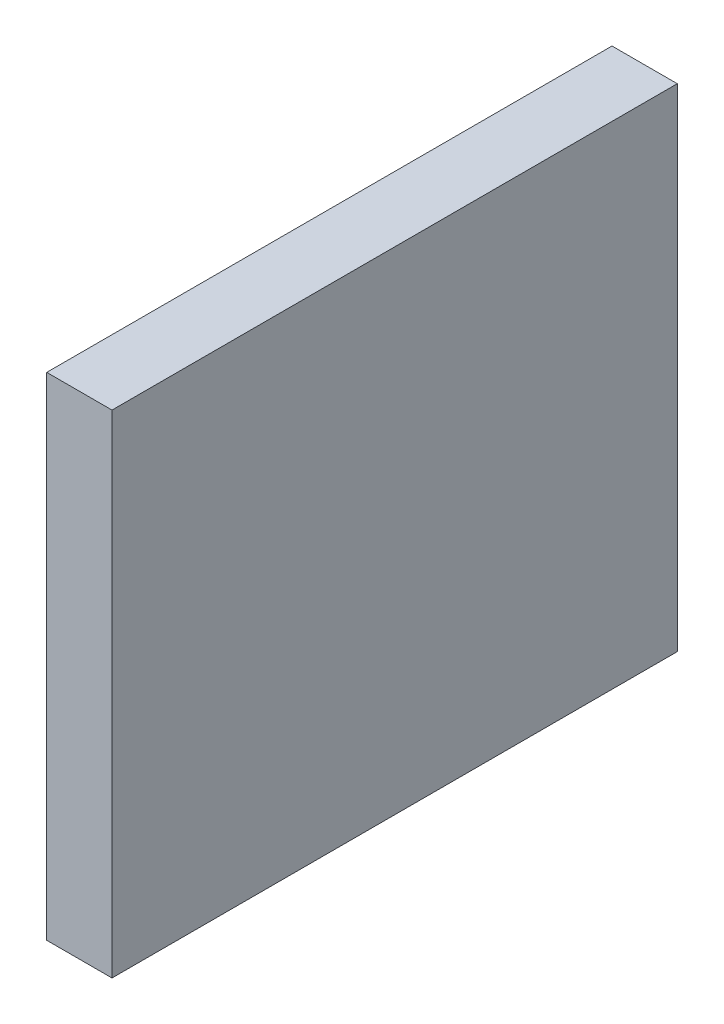
ISO-10303-21;
HEADER;
FILE_DESCRIPTION(('STEP AP214'),'2;1');
FILE_NAME('part.step','',(''),(''),'','','');
FILE_SCHEMA(('AUTOMOTIVE_DESIGN { 1 0 10303 214 1 1 1 1 }'));
ENDSEC;
DATA;
#1=APPLICATION_CONTEXT('core data for automotive mechanical design processes');
#2=APPLICATION_PROTOCOL_DEFINITION('international standard','automotive_design',2000,#1);
#3=PRODUCT_CONTEXT('',#1,'mechanical');
#4=PRODUCT('Part','Part','',(#3));
#5=PRODUCT_RELATED_PRODUCT_CATEGORY('part','',(#4));
#6=PRODUCT_DEFINITION_FORMATION('','',#4);
#7=PRODUCT_DEFINITION_CONTEXT('part definition',#1,'design');
#8=PRODUCT_DEFINITION('design','',#6,#7);
#9=PRODUCT_DEFINITION_SHAPE('','',#8);
#10=(LENGTH_UNIT() NAMED_UNIT(*) SI_UNIT(.MILLI.,.METRE.));
#11=(NAMED_UNIT(*) PLANE_ANGLE_UNIT() SI_UNIT($,.RADIAN.));
#12=(NAMED_UNIT(*) SI_UNIT($,.STERADIAN.) SOLID_ANGLE_UNIT());
#13=UNCERTAINTY_MEASURE_WITH_UNIT(LENGTH_MEASURE(1.E-05),#10,'distance_accuracy_value','');
#14=(GEOMETRIC_REPRESENTATION_CONTEXT(3) GLOBAL_UNCERTAINTY_ASSIGNED_CONTEXT((#13)) GLOBAL_UNIT_ASSIGNED_CONTEXT((#10,
#11,#12)) REPRESENTATION_CONTEXT('',''));
#15=CARTESIAN_POINT('',(0.,0.,0.));
#16=DIRECTION('',(0.,0.,1.));
#17=DIRECTION('',(1.,0.,0.));
#18=AXIS2_PLACEMENT_3D('',#15,#16,#17);
#19=CARTESIAN_POINT('',(21.1649890422365,13.3138602307418,28.7224037022303));
#20=DIRECTION('',(0.,0.,1.));
#21=DIRECTION('',(0.,-1.,0.));
#22=AXIS2_PLACEMENT_3D('',#19,#20,#21);
#23=PLANE('',#22);
#24=DIRECTION('',(0.,-1.,0.));
#25=VECTOR('',#24,1.);
#26=CARTESIAN_POINT('',(21.3428080531015,13.3138602307418,28.7224037022303));
#27=LINE('',#26,#25);
#28=CARTESIAN_POINT('',(21.3428080531015,13.3138602307418,28.7224037022303));
#29=VERTEX_POINT('',#28);
#30=CARTESIAN_POINT('',(21.3428080531015,11.9741613642592,28.7224037022303));
#31=VERTEX_POINT('',#30);
#32=EDGE_CURVE('E80',#29,#31,#27,.T.);
#33=ORIENTED_EDGE('',*,*,#32,.F.);
#34=DIRECTION('',(1.,0.,0.));
#35=VECTOR('',#34,1.);
#36=CARTESIAN_POINT('',(21.1649890422365,13.3138602307418,28.7224037022303));
#37=LINE('',#36,#35);
#38=CARTESIAN_POINT('',(21.1649890422365,13.3138602307418,28.7224037022303));
#39=VERTEX_POINT('',#38);
#40=EDGE_CURVE('E33',#39,#29,#37,.T.);
#41=ORIENTED_EDGE('',*,*,#40,.F.);
#42=DIRECTION('',(0.,-1.,0.));
#43=VECTOR('',#42,1.);
#44=CARTESIAN_POINT('',(21.1649890422365,13.3138602307418,28.7224037022303));
#45=LINE('',#44,#43);
#46=CARTESIAN_POINT('',(21.1649890422365,11.9741613642592,28.7224037022303));
#47=VERTEX_POINT('',#46);
#48=EDGE_CURVE('E72',#39,#47,#45,.T.);
#49=ORIENTED_EDGE('',*,*,#48,.T.);
#50=DIRECTION('',(1.,0.,0.));
#51=VECTOR('',#50,1.);
#52=CARTESIAN_POINT('',(21.1649890422365,11.9741613642592,28.7224037022303));
#53=LINE('',#52,#51);
#54=EDGE_CURVE('E11',#47,#31,#53,.T.);
#55=ORIENTED_EDGE('',*,*,#54,.T.);
#56=EDGE_LOOP('',(#33,#41,#49,#55));
#57=FACE_BOUND('',#56,.T.);
#58=ADVANCED_FACE('F17',(#57),#23,.T.);
#59=CARTESIAN_POINT('',(21.1649890422365,11.9741613642592,28.7224037022303));
#60=DIRECTION('',(0.,-1.,0.));
#61=DIRECTION('',(0.,0.,-1.));
#62=AXIS2_PLACEMENT_3D('',#59,#60,#61);
#63=PLANE('',#62);
#64=DIRECTION('',(0.,0.,-1.));
#65=VECTOR('',#64,1.);
#66=CARTESIAN_POINT('',(21.3428080531015,11.9741613642592,28.7224037022303));
#67=LINE('',#66,#65);
#68=CARTESIAN_POINT('',(21.3428080531015,11.9741613642592,27.1827048357478));
#69=VERTEX_POINT('',#68);
#70=EDGE_CURVE('E83',#31,#69,#67,.T.);
#71=ORIENTED_EDGE('',*,*,#70,.F.);
#72=ORIENTED_EDGE('',*,*,#54,.F.);
#73=DIRECTION('',(0.,0.,-1.));
#74=VECTOR('',#73,1.);
#75=CARTESIAN_POINT('',(21.1649890422365,11.9741613642592,28.7224037022303));
#76=LINE('',#75,#74);
#77=CARTESIAN_POINT('',(21.1649890422365,11.9741613642592,27.1827048357478));
#78=VERTEX_POINT('',#77);
#79=EDGE_CURVE('E68',#47,#78,#76,.T.);
#80=ORIENTED_EDGE('',*,*,#79,.T.);
#81=DIRECTION('',(1.,0.,0.));
#82=VECTOR('',#81,1.);
#83=CARTESIAN_POINT('',(21.1649890422365,11.9741613642592,27.1827048357478));
#84=LINE('',#83,#82);
#85=EDGE_CURVE('E25',#78,#69,#84,.T.);
#86=ORIENTED_EDGE('',*,*,#85,.T.);
#87=EDGE_LOOP('',(#71,#72,#80,#86));
#88=FACE_BOUND('',#87,.T.);
#89=ADVANCED_FACE('F69',(#88),#63,.T.);
#90=CARTESIAN_POINT('',(21.1649890422365,11.9741613642592,27.1827048357478));
#91=DIRECTION('',(0.,0.,-1.));
#92=DIRECTION('',(0.,1.,0.));
#93=AXIS2_PLACEMENT_3D('',#90,#91,#92);
#94=PLANE('',#93);
#95=DIRECTION('',(0.,1.,0.));
#96=VECTOR('',#95,1.);
#97=CARTESIAN_POINT('',(21.3428080531015,11.9741613642592,27.1827048357478));
#98=LINE('',#97,#96);
#99=CARTESIAN_POINT('',(21.3428080531015,13.3138602307418,27.1827048357478));
#100=VERTEX_POINT('',#99);
#101=EDGE_CURVE('E66',#69,#100,#98,.T.);
#102=ORIENTED_EDGE('',*,*,#101,.F.);
#103=ORIENTED_EDGE('',*,*,#85,.F.);
#104=DIRECTION('',(0.,1.,0.));
#105=VECTOR('',#104,1.);
#106=CARTESIAN_POINT('',(21.1649890422365,11.9741613642592,27.1827048357478));
#107=LINE('',#106,#105);
#108=CARTESIAN_POINT('',(21.1649890422365,13.3138602307418,27.1827048357478));
#109=VERTEX_POINT('',#108);
#110=EDGE_CURVE('E63',#78,#109,#107,.T.);
#111=ORIENTED_EDGE('',*,*,#110,.T.);
#112=DIRECTION('',(1.,0.,0.));
#113=VECTOR('',#112,1.);
#114=CARTESIAN_POINT('',(21.1649890422365,13.3138602307418,27.1827048357478));
#115=LINE('',#114,#113);
#116=EDGE_CURVE('E49',#109,#100,#115,.T.);
#117=ORIENTED_EDGE('',*,*,#116,.T.);
#118=EDGE_LOOP('',(#102,#103,#111,#117));
#119=FACE_BOUND('',#118,.T.);
#120=ADVANCED_FACE('F61',(#119),#94,.T.);
#121=CARTESIAN_POINT('',(21.1649890422365,13.3138602307418,27.1827048357478));
#122=DIRECTION('',(0.,1.,0.));
#123=DIRECTION('',(0.,0.,1.));
#124=AXIS2_PLACEMENT_3D('',#121,#122,#123);
#125=PLANE('',#124);
#126=DIRECTION('',(0.,0.,1.));
#127=VECTOR('',#126,1.);
#128=CARTESIAN_POINT('',(21.3428080531015,13.3138602307418,27.1827048357478));
#129=LINE('',#128,#127);
#130=EDGE_CURVE('E86',#100,#29,#129,.T.);
#131=ORIENTED_EDGE('',*,*,#130,.F.);
#132=ORIENTED_EDGE('',*,*,#116,.F.);
#133=DIRECTION('',(0.,0.,1.));
#134=VECTOR('',#133,1.);
#135=CARTESIAN_POINT('',(21.1649890422365,13.3138602307418,27.1827048357478));
#136=LINE('',#135,#134);
#137=EDGE_CURVE('E75',#109,#39,#136,.T.);
#138=ORIENTED_EDGE('',*,*,#137,.T.);
#139=ORIENTED_EDGE('',*,*,#40,.T.);
#140=EDGE_LOOP('',(#131,#132,#138,#139));
#141=FACE_BOUND('',#140,.T.);
#142=ADVANCED_FACE('F98',(#141),#125,.T.);
#143=CARTESIAN_POINT('',(21.1649890422365,12.7440107975005,20.452554268989));
#144=DIRECTION('',(1.,0.,0.));
#145=DIRECTION('',(0.,1.,0.));
#146=AXIS2_PLACEMENT_3D('',#143,#144,#145);
#147=PLANE('',#146);
#148=ORIENTED_EDGE('',*,*,#48,.F.);
#149=ORIENTED_EDGE('',*,*,#137,.F.);
#150=ORIENTED_EDGE('',*,*,#110,.F.);
#151=ORIENTED_EDGE('',*,*,#79,.F.);
#152=EDGE_LOOP('',(#148,#149,#150,#151));
#153=FACE_BOUND('',#152,.T.);
#154=ADVANCED_FACE('F74',(#153),#147,.F.);
#155=CARTESIAN_POINT('',(21.3428080531015,12.7440107975005,20.452554268989));
#156=DIRECTION('',(1.,0.,0.));
#157=DIRECTION('',(0.,1.,0.));
#158=AXIS2_PLACEMENT_3D('',#155,#156,#157);
#159=PLANE('',#158);
#160=ORIENTED_EDGE('',*,*,#32,.T.);
#161=ORIENTED_EDGE('',*,*,#70,.T.);
#162=ORIENTED_EDGE('',*,*,#101,.T.);
#163=ORIENTED_EDGE('',*,*,#130,.T.);
#164=EDGE_LOOP('',(#160,#161,#162,#163));
#165=FACE_BOUND('',#164,.T.);
#166=ADVANCED_FACE('F90',(#165),#159,.T.);
#167=CLOSED_SHELL('',(#58,#89,#120,#142,#154,#166));
#168=MANIFOLD_SOLID_BREP('B1',#167);
#169=ADVANCED_BREP_SHAPE_REPRESENTATION('',(#18,#168),#14);
#170=SHAPE_DEFINITION_REPRESENTATION(#9,#169);
ENDSEC;
END-ISO-10303-21;
